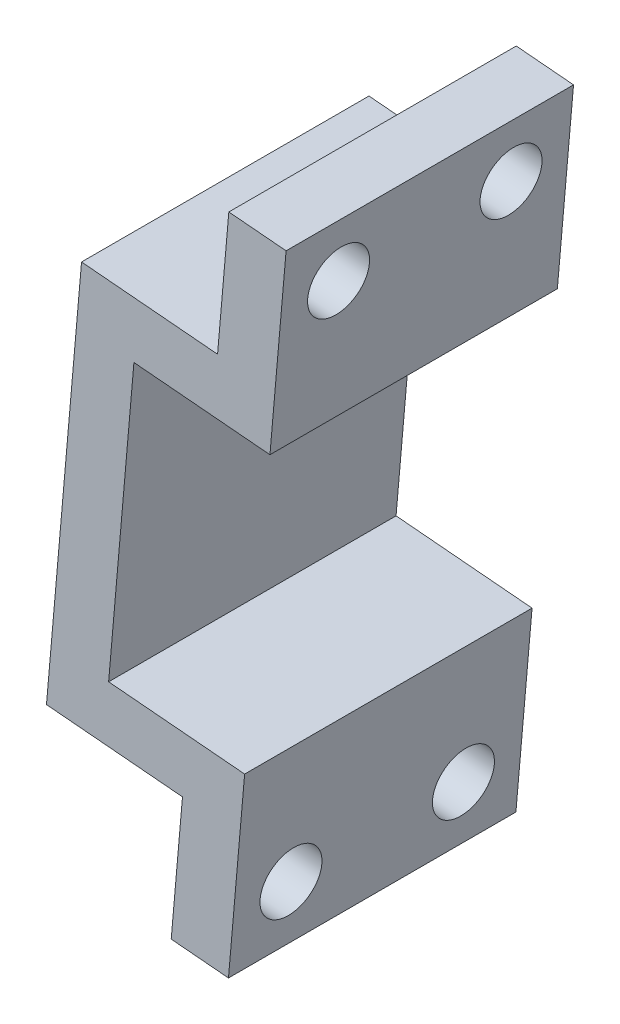
ISO-10303-21;
HEADER;
FILE_DESCRIPTION(('STEP AP214'),'2;1');
FILE_NAME('part.step','',(''),(''),'','','');
FILE_SCHEMA(('AUTOMOTIVE_DESIGN { 1 0 10303 214 1 1 1 1 }'));
ENDSEC;
DATA;
#1=APPLICATION_CONTEXT('core data for automotive mechanical design processes');
#2=APPLICATION_PROTOCOL_DEFINITION('international standard','automotive_design',2000,#1);
#3=PRODUCT_CONTEXT('',#1,'mechanical');
#4=PRODUCT('Part','Part','',(#3));
#5=PRODUCT_RELATED_PRODUCT_CATEGORY('part','',(#4));
#6=PRODUCT_DEFINITION_FORMATION('','',#4);
#7=PRODUCT_DEFINITION_CONTEXT('part definition',#1,'design');
#8=PRODUCT_DEFINITION('design','',#6,#7);
#9=PRODUCT_DEFINITION_SHAPE('','',#8);
#10=(LENGTH_UNIT() NAMED_UNIT(*) SI_UNIT(.MILLI.,.METRE.));
#11=(NAMED_UNIT(*) PLANE_ANGLE_UNIT() SI_UNIT($,.RADIAN.));
#12=(NAMED_UNIT(*) SI_UNIT($,.STERADIAN.) SOLID_ANGLE_UNIT());
#13=UNCERTAINTY_MEASURE_WITH_UNIT(LENGTH_MEASURE(1.E-05),#10,'distance_accuracy_value','');
#14=(GEOMETRIC_REPRESENTATION_CONTEXT(3) GLOBAL_UNCERTAINTY_ASSIGNED_CONTEXT((#13)) GLOBAL_UNIT_ASSIGNED_CONTEXT((#10,
#11,#12)) REPRESENTATION_CONTEXT('',''));
#15=CARTESIAN_POINT('',(0.,0.,0.));
#16=DIRECTION('',(0.,0.,1.));
#17=DIRECTION('',(1.,0.,0.));
#18=AXIS2_PLACEMENT_3D('',#15,#16,#17);
#19=CARTESIAN_POINT('',(-81.4379855977888,9.99530320807717,-20.));
#20=DIRECTION('',(-0.996194698091746,0.0871557427476528,0.));
#21=DIRECTION('',(-0.0871557427476528,-0.996194698091746,0.));
#22=AXIS2_PLACEMENT_3D('',#19,#20,#21);
#23=PLANE('',#22);
#24=CARTESIAN_POINT('',(-81.0022068840506,14.9762766985351,-4.00000000000464));
#25=DIRECTION('',(-0.996194698091745,0.0871557427476621,0.));
#26=DIRECTION('',(-0.0871557427476621,-0.996194698091745,0.));
#27=AXIS2_PLACEMENT_3D('',#24,#25,#26);
#28=CIRCLE('',#27,2.15);
#29=CARTESIAN_POINT('',(-81.189591730958,12.8344580976379,-4.00000000000464));
#30=VERTEX_POINT('',#29);
#31=EDGE_CURVE('E327',#30,#30,#28,.T.);
#32=ORIENTED_EDGE('',*,*,#31,.F.);
#33=EDGE_LOOP('',(#32));
#34=FACE_BOUND('',#33,.T.);
#35=CARTESIAN_POINT('',(-81.0022068840506,14.9762766985351,-16.0000000000046));
#36=DIRECTION('',(-0.996194698091745,0.0871557427476621,0.));
#37=DIRECTION('',(-0.0871557427476621,-0.996194698091745,0.));
#38=AXIS2_PLACEMENT_3D('',#35,#36,#37);
#39=CIRCLE('',#38,2.15);
#40=CARTESIAN_POINT('',(-81.189591730958,12.8344580976379,-16.0000000000046));
#41=VERTEX_POINT('',#40);
#42=EDGE_CURVE('E325',#41,#41,#39,.T.);
#43=ORIENTED_EDGE('',*,*,#42,.F.);
#44=EDGE_LOOP('',(#43));
#45=FACE_BOUND('',#44,.T.);
#46=DIRECTION('',(-0.0871557427476528,-0.996194698091746,0.));
#47=VECTOR('',#46,1.);
#48=CARTESIAN_POINT('',(-81.4379855977888,9.99530320807717,0.));
#49=LINE('',#48,#47);
#50=CARTESIAN_POINT('',(-80.6535839130599,18.9610554909029,0.));
#51=VERTEX_POINT('',#50);
#52=CARTESIAN_POINT('',(-81.4379855977888,9.99530320807717,0.));
#53=VERTEX_POINT('',#52);
#54=EDGE_CURVE('E155',#51,#53,#49,.T.);
#55=ORIENTED_EDGE('',*,*,#54,.F.);
#56=DIRECTION('',(0.,0.,1.));
#57=VECTOR('',#56,1.);
#58=CARTESIAN_POINT('',(-80.6535839130599,18.9610554909029,-20.));
#59=LINE('',#58,#57);
#60=CARTESIAN_POINT('',(-80.6535839130599,18.9610554909029,-20.));
#61=VERTEX_POINT('',#60);
#62=EDGE_CURVE('E11',#61,#51,#59,.T.);
#63=ORIENTED_EDGE('',*,*,#62,.F.);
#64=DIRECTION('',(-0.0871557427476528,-0.996194698091746,0.));
#65=VECTOR('',#64,1.);
#66=CARTESIAN_POINT('',(-81.4379855977888,9.99530320807717,-20.));
#67=LINE('',#66,#65);
#68=CARTESIAN_POINT('',(-81.4379855977888,9.99530320807717,-20.));
#69=VERTEX_POINT('',#68);
#70=EDGE_CURVE('E187',#61,#69,#67,.T.);
#71=ORIENTED_EDGE('',*,*,#70,.T.);
#72=DIRECTION('',(0.,0.,1.));
#73=VECTOR('',#72,1.);
#74=CARTESIAN_POINT('',(-81.4379855977888,9.99530320807717,-20.));
#75=LINE('',#74,#73);
#76=EDGE_CURVE('E101',#69,#53,#75,.T.);
#77=ORIENTED_EDGE('',*,*,#76,.T.);
#78=EDGE_LOOP('',(#55,#63,#71,#77));
#79=FACE_BOUND('',#78,.T.);
#80=ADVANCED_FACE('F33',(#34,#45,#79),#23,.T.);
#81=CARTESIAN_POINT('',(-80.6535839130599,18.9610554909029,-20.));
#82=DIRECTION('',(0.0871557427476604,0.996194698091745,0.));
#83=DIRECTION('',(-0.996194698091745,0.0871557427476604,0.));
#84=AXIS2_PLACEMENT_3D('',#81,#82,#83);
#85=PLANE('',#84);
#86=DIRECTION('',(-0.996194698091745,0.0871557427476604,0.));
#87=VECTOR('',#86,1.);
#88=CARTESIAN_POINT('',(-80.6535839130599,18.9610554909029,0.));
#89=LINE('',#88,#87);
#90=CARTESIAN_POINT('',(-76.6688051206929,18.6124325199122,0.));
#91=VERTEX_POINT('',#90);
#92=EDGE_CURVE('E185',#91,#51,#89,.T.);
#93=ORIENTED_EDGE('',*,*,#92,.F.);
#94=DIRECTION('',(0.,0.,1.));
#95=VECTOR('',#94,1.);
#96=CARTESIAN_POINT('',(-76.6688051206929,18.6124325199122,-20.));
#97=LINE('',#96,#95);
#98=CARTESIAN_POINT('',(-76.6688051206929,18.6124325199122,-20.));
#99=VERTEX_POINT('',#98);
#100=EDGE_CURVE('E42',#99,#91,#97,.T.);
#101=ORIENTED_EDGE('',*,*,#100,.F.);
#102=DIRECTION('',(-0.996194698091745,0.0871557427476604,0.));
#103=VECTOR('',#102,1.);
#104=CARTESIAN_POINT('',(-80.6535839130599,18.9610554909029,-20.));
#105=LINE('',#104,#103);
#106=EDGE_CURVE('E145',#99,#61,#105,.T.);
#107=ORIENTED_EDGE('',*,*,#106,.T.);
#108=ORIENTED_EDGE('',*,*,#62,.T.);
#109=EDGE_LOOP('',(#93,#101,#107,#108));
#110=FACE_BOUND('',#109,.T.);
#111=ADVANCED_FACE('F267',(#110),#85,.T.);
#112=CARTESIAN_POINT('',(-76.6688051206929,18.6124325199122,-20.));
#113=DIRECTION('',(0.996194698091746,-0.0871557427476556,0.));
#114=DIRECTION('',(0.0871557427476556,0.996194698091746,0.));
#115=AXIS2_PLACEMENT_3D('',#112,#113,#114);
#116=PLANE('',#115);
#117=CARTESIAN_POINT('',(-77.0174280916836,14.6276537275445,-4.00000000000464));
#118=DIRECTION('',(0.996194698091746,-0.0871557427476556,0.));
#119=DIRECTION('',(0.0871557427476556,0.996194698091746,0.));
#120=AXIS2_PLACEMENT_3D('',#117,#118,#119);
#121=CIRCLE('',#120,2.15);
#122=CARTESIAN_POINT('',(-76.8300432447762,16.7694723284417,-4.00000000000464));
#123=VERTEX_POINT('',#122);
#124=EDGE_CURVE('E36',#123,#123,#121,.T.);
#125=ORIENTED_EDGE('',*,*,#124,.F.);
#126=EDGE_LOOP('',(#125));
#127=FACE_BOUND('',#126,.T.);
#128=CARTESIAN_POINT('',(-77.0174280916836,14.6276537275445,-16.0000000000046));
#129=DIRECTION('',(0.996194698091746,-0.0871557427476556,0.));
#130=DIRECTION('',(0.0871557427476556,0.996194698091746,0.));
#131=AXIS2_PLACEMENT_3D('',#128,#129,#130);
#132=CIRCLE('',#131,2.15);
#133=CARTESIAN_POINT('',(-76.8300432447762,16.7694723284417,-16.0000000000046));
#134=VERTEX_POINT('',#133);
#135=EDGE_CURVE('E205',#134,#134,#132,.T.);
#136=ORIENTED_EDGE('',*,*,#135,.F.);
#137=EDGE_LOOP('',(#136));
#138=FACE_BOUND('',#137,.T.);
#139=DIRECTION('',(0.0871557427476556,0.996194698091746,0.));
#140=VECTOR('',#139,1.);
#141=CARTESIAN_POINT('',(-76.6688051206929,18.6124325199122,0.));
#142=LINE('',#141,#140);
#143=CARTESIAN_POINT('',(-77.7931142021377,5.76152091452872,0.));
#144=VERTEX_POINT('',#143);
#145=EDGE_CURVE('E132',#144,#91,#142,.T.);
#146=ORIENTED_EDGE('',*,*,#145,.F.);
#147=DIRECTION('',(0.,0.,1.));
#148=VECTOR('',#147,1.);
#149=CARTESIAN_POINT('',(-77.7931142021377,5.76152091452872,-20.));
#150=LINE('',#149,#148);
#151=CARTESIAN_POINT('',(-77.7931142021377,5.76152091452872,-20.));
#152=VERTEX_POINT('',#151);
#153=EDGE_CURVE('E127',#152,#144,#150,.T.);
#154=ORIENTED_EDGE('',*,*,#153,.F.);
#155=DIRECTION('',(0.0871557427476556,0.996194698091746,0.));
#156=VECTOR('',#155,1.);
#157=CARTESIAN_POINT('',(-76.6688051206929,18.6124325199122,-20.));
#158=LINE('',#157,#156);
#159=EDGE_CURVE('E130',#152,#99,#158,.T.);
#160=ORIENTED_EDGE('',*,*,#159,.T.);
#161=ORIENTED_EDGE('',*,*,#100,.T.);
#162=EDGE_LOOP('',(#146,#154,#160,#161));
#163=FACE_BOUND('',#162,.T.);
#164=ADVANCED_FACE('F129',(#127,#138,#163),#116,.T.);
#165=CARTESIAN_POINT('',(-77.7931142021377,5.76152091452872,-20.));
#166=DIRECTION('',(-0.087155742747662,-0.996194698091745,0.));
#167=DIRECTION('',(0.996194698091745,-0.087155742747662,0.));
#168=AXIS2_PLACEMENT_3D('',#165,#166,#167);
#169=PLANE('',#168);
#170=DIRECTION('',(0.996194698091745,-0.087155742747662,0.));
#171=VECTOR('',#170,1.);
#172=CARTESIAN_POINT('',(-77.7931142021377,5.76152091452872,0.));
#173=LINE('',#172,#171);
#174=CARTESIAN_POINT('',(-87.2569638340093,6.58950047063151,0.));
#175=VERTEX_POINT('',#174);
#176=EDGE_CURVE('E182',#175,#144,#173,.T.);
#177=ORIENTED_EDGE('',*,*,#176,.F.);
#178=DIRECTION('',(0.,0.,1.));
#179=VECTOR('',#178,1.);
#180=CARTESIAN_POINT('',(-87.2569638340093,6.58950047063151,-20.));
#181=LINE('',#180,#179);
#182=CARTESIAN_POINT('',(-87.2569638340093,6.58950047063151,-20.));
#183=VERTEX_POINT('',#182);
#184=EDGE_CURVE('E137',#183,#175,#181,.T.);
#185=ORIENTED_EDGE('',*,*,#184,.F.);
#186=DIRECTION('',(0.996194698091745,-0.087155742747662,0.));
#187=VECTOR('',#186,1.);
#188=CARTESIAN_POINT('',(-77.7931142021377,5.76152091452872,-20.));
#189=LINE('',#188,#187);
#190=EDGE_CURVE('E143',#183,#152,#189,.T.);
#191=ORIENTED_EDGE('',*,*,#190,.T.);
#192=ORIENTED_EDGE('',*,*,#153,.T.);
#193=EDGE_LOOP('',(#177,#185,#191,#192));
#194=FACE_BOUND('',#193,.T.);
#195=ADVANCED_FACE('F147',(#194),#169,.T.);
#196=CARTESIAN_POINT('',(-87.2569638340093,6.58950047063151,-20.));
#197=DIRECTION('',(0.996194698091745,-0.0871557427476616,0.));
#198=DIRECTION('',(0.0871557427476616,0.996194698091745,0.));
#199=AXIS2_PLACEMENT_3D('',#196,#197,#198);
#200=PLANE('',#199);
#201=DIRECTION('',(0.0871557427476616,0.996194698091745,0.));
#202=VECTOR('',#201,1.);
#203=CARTESIAN_POINT('',(-87.2569638340093,6.58950047063151,0.));
#204=LINE('',#203,#202);
#205=CARTESIAN_POINT('',(-89.017509837512,-13.5336324308218,0.));
#206=VERTEX_POINT('',#205);
#207=EDGE_CURVE('E179',#206,#175,#204,.T.);
#208=ORIENTED_EDGE('',*,*,#207,.F.);
#209=DIRECTION('',(0.,0.,1.));
#210=VECTOR('',#209,1.);
#211=CARTESIAN_POINT('',(-89.017509837512,-13.5336324308218,-20.));
#212=LINE('',#211,#210);
#213=CARTESIAN_POINT('',(-89.017509837512,-13.5336324308218,-20.));
#214=VERTEX_POINT('',#213);
#215=EDGE_CURVE('E191',#214,#206,#212,.T.);
#216=ORIENTED_EDGE('',*,*,#215,.F.);
#217=DIRECTION('',(0.0871557427476616,0.996194698091745,0.));
#218=VECTOR('',#217,1.);
#219=CARTESIAN_POINT('',(-87.2569638340093,6.58950047063151,-20.));
#220=LINE('',#219,#218);
#221=EDGE_CURVE('E148',#214,#183,#220,.T.);
#222=ORIENTED_EDGE('',*,*,#221,.T.);
#223=ORIENTED_EDGE('',*,*,#184,.T.);
#224=EDGE_LOOP('',(#208,#216,#222,#223));
#225=FACE_BOUND('',#224,.T.);
#226=ADVANCED_FACE('F282',(#225),#200,.T.);
#227=CARTESIAN_POINT('',(-89.017509837512,-13.5336324308218,-20.));
#228=DIRECTION('',(0.0871557427476617,0.996194698091745,0.));
#229=DIRECTION('',(-0.996194698091745,0.0871557427476617,0.));
#230=AXIS2_PLACEMENT_3D('',#227,#228,#229);
#231=PLANE('',#230);
#232=DIRECTION('',(-0.996194698091745,0.0871557427476617,0.));
#233=VECTOR('',#232,1.);
#234=CARTESIAN_POINT('',(-89.017509837512,-13.5336324308218,0.));
#235=LINE('',#234,#233);
#236=CARTESIAN_POINT('',(-79.5536602056405,-14.3616119869246,0.));
#237=VERTEX_POINT('',#236);
#238=EDGE_CURVE('E176',#237,#206,#235,.T.);
#239=ORIENTED_EDGE('',*,*,#238,.F.);
#240=DIRECTION('',(0.,0.,1.));
#241=VECTOR('',#240,1.);
#242=CARTESIAN_POINT('',(-79.5536602056405,-14.3616119869246,-20.));
#243=LINE('',#242,#241);
#244=CARTESIAN_POINT('',(-79.5536602056405,-14.3616119869246,-20.));
#245=VERTEX_POINT('',#244);
#246=EDGE_CURVE('E193',#245,#237,#243,.T.);
#247=ORIENTED_EDGE('',*,*,#246,.F.);
#248=DIRECTION('',(-0.996194698091745,0.0871557427476617,0.));
#249=VECTOR('',#248,1.);
#250=CARTESIAN_POINT('',(-89.017509837512,-13.5336324308218,-20.));
#251=LINE('',#250,#249);
#252=EDGE_CURVE('E150',#245,#214,#251,.T.);
#253=ORIENTED_EDGE('',*,*,#252,.T.);
#254=ORIENTED_EDGE('',*,*,#215,.T.);
#255=EDGE_LOOP('',(#239,#247,#253,#254));
#256=FACE_BOUND('',#255,.T.);
#257=ADVANCED_FACE('F242',(#256),#231,.T.);
#258=CARTESIAN_POINT('',(-79.5536602056405,-14.3616119869246,-20.));
#259=DIRECTION('',(0.996194698091745,-0.0871557427476612,0.));
#260=DIRECTION('',(0.0871557427476612,0.996194698091745,0.));
#261=AXIS2_PLACEMENT_3D('',#258,#259,#260);
#262=PLANE('',#261);
#263=CARTESIAN_POINT('',(-80.3293463160947,-23.2277447999419,-16.0000000000046));
#264=DIRECTION('',(0.996194698091745,-0.0871557427476612,0.));
#265=DIRECTION('',(0.0871557427476612,0.996194698091745,0.));
#266=AXIS2_PLACEMENT_3D('',#263,#264,#265);
#267=CIRCLE('',#266,2.15000000000002);
#268=CARTESIAN_POINT('',(-80.1419614691873,-21.0859261990446,-16.0000000000046));
#269=VERTEX_POINT('',#268);
#270=EDGE_CURVE('E207',#269,#269,#267,.T.);
#271=ORIENTED_EDGE('',*,*,#270,.F.);
#272=EDGE_LOOP('',(#271));
#273=FACE_BOUND('',#272,.T.);
#274=CARTESIAN_POINT('',(-80.3293463160947,-23.2277447999419,-4.00000000000464));
#275=DIRECTION('',(0.996194698091745,-0.0871557427476612,0.));
#276=DIRECTION('',(0.0871557427476612,0.996194698091745,0.));
#277=AXIS2_PLACEMENT_3D('',#274,#275,#276);
#278=CIRCLE('',#277,2.15000000000002);
#279=CARTESIAN_POINT('',(-80.1419614691873,-21.0859261990446,-4.00000000000464));
#280=VERTEX_POINT('',#279);
#281=EDGE_CURVE('E212',#280,#280,#278,.T.);
#282=ORIENTED_EDGE('',*,*,#281,.F.);
#283=EDGE_LOOP('',(#282));
#284=FACE_BOUND('',#283,.T.);
#285=DIRECTION('',(0.0871557427476612,0.996194698091745,0.));
#286=VECTOR('',#285,1.);
#287=CARTESIAN_POINT('',(-79.5536602056405,-14.3616119869246,0.));
#288=LINE('',#287,#286);
#289=CARTESIAN_POINT('',(-80.6779692870853,-27.2125235923081,0.));
#290=VERTEX_POINT('',#289);
#291=EDGE_CURVE('E173',#290,#237,#288,.T.);
#292=ORIENTED_EDGE('',*,*,#291,.F.);
#293=DIRECTION('',(0.,0.,1.));
#294=VECTOR('',#293,1.);
#295=CARTESIAN_POINT('',(-80.6779692870853,-27.2125235923081,-20.));
#296=LINE('',#295,#294);
#297=CARTESIAN_POINT('',(-80.6779692870853,-27.2125235923081,-20.));
#298=VERTEX_POINT('',#297);
#299=EDGE_CURVE('E195',#298,#290,#296,.T.);
#300=ORIENTED_EDGE('',*,*,#299,.F.);
#301=DIRECTION('',(0.0871557427476612,0.996194698091745,0.));
#302=VECTOR('',#301,1.);
#303=CARTESIAN_POINT('',(-79.5536602056405,-14.3616119869246,-20.));
#304=LINE('',#303,#302);
#305=EDGE_CURVE('E236',#298,#245,#304,.T.);
#306=ORIENTED_EDGE('',*,*,#305,.T.);
#307=ORIENTED_EDGE('',*,*,#246,.T.);
#308=EDGE_LOOP('',(#292,#300,#306,#307));
#309=FACE_BOUND('',#308,.T.);
#310=ADVANCED_FACE('F248',(#273,#284,#309),#262,.T.);
#311=CARTESIAN_POINT('',(-80.6779692870853,-27.2125235923081,-20.));
#312=DIRECTION('',(-0.0871557427476612,-0.996194698091745,0.));
#313=DIRECTION('',(0.996194698091745,-0.0871557427476612,0.));
#314=AXIS2_PLACEMENT_3D('',#311,#312,#313);
#315=PLANE('',#314);
#316=DIRECTION('',(0.996194698091745,-0.0871557427476612,0.));
#317=VECTOR('',#316,1.);
#318=CARTESIAN_POINT('',(-80.6779692870853,-27.2125235923081,0.));
#319=LINE('',#318,#317);
#320=CARTESIAN_POINT('',(-84.6627480794523,-26.8639006213174,0.));
#321=VERTEX_POINT('',#320);
#322=EDGE_CURVE('E170',#321,#290,#319,.T.);
#323=ORIENTED_EDGE('',*,*,#322,.F.);
#324=DIRECTION('',(0.,0.,1.));
#325=VECTOR('',#324,1.);
#326=CARTESIAN_POINT('',(-84.6627480794523,-26.8639006213174,-20.));
#327=LINE('',#326,#325);
#328=CARTESIAN_POINT('',(-84.6627480794523,-26.8639006213174,-20.));
#329=VERTEX_POINT('',#328);
#330=EDGE_CURVE('E197',#329,#321,#327,.T.);
#331=ORIENTED_EDGE('',*,*,#330,.F.);
#332=DIRECTION('',(0.996194698091745,-0.0871557427476612,0.));
#333=VECTOR('',#332,1.);
#334=CARTESIAN_POINT('',(-80.6779692870853,-27.2125235923081,-20.));
#335=LINE('',#334,#333);
#336=EDGE_CURVE('E233',#329,#298,#335,.T.);
#337=ORIENTED_EDGE('',*,*,#336,.T.);
#338=ORIENTED_EDGE('',*,*,#299,.T.);
#339=EDGE_LOOP('',(#323,#331,#337,#338));
#340=FACE_BOUND('',#339,.T.);
#341=ADVANCED_FACE('F251',(#340),#315,.T.);
#342=CARTESIAN_POINT('',(-84.6627480794523,-26.8639006213174,-20.));
#343=DIRECTION('',(-0.996194698091745,0.0871557427476607,0.));
#344=DIRECTION('',(-0.0871557427476607,-0.996194698091745,0.));
#345=AXIS2_PLACEMENT_3D('',#342,#343,#344);
#346=PLANE('',#345);
#347=CARTESIAN_POINT('',(-84.3141251084617,-22.8791218289512,-16.0000000000046));
#348=DIRECTION('',(-0.996194698091745,0.0871557427476621,0.));
#349=DIRECTION('',(-0.0871557427476621,-0.996194698091745,0.));
#350=AXIS2_PLACEMENT_3D('',#347,#348,#349);
#351=CIRCLE('',#350,2.15000000000002);
#352=CARTESIAN_POINT('',(-84.5015099553692,-25.0209404298485,-16.0000000000046));
#353=VERTEX_POINT('',#352);
#354=EDGE_CURVE('E330',#353,#353,#351,.T.);
#355=ORIENTED_EDGE('',*,*,#354,.F.);
#356=EDGE_LOOP('',(#355));
#357=FACE_BOUND('',#356,.T.);
#358=CARTESIAN_POINT('',(-84.3141251084617,-22.8791218289512,-4.00000000000464));
#359=DIRECTION('',(-0.996194698091745,0.0871557427476621,0.));
#360=DIRECTION('',(-0.0871557427476621,-0.996194698091745,0.));
#361=AXIS2_PLACEMENT_3D('',#358,#359,#360);
#362=CIRCLE('',#361,2.15000000000002);
#363=CARTESIAN_POINT('',(-84.5015099553692,-25.0209404298485,-4.00000000000464));
#364=VERTEX_POINT('',#363);
#365=EDGE_CURVE('E217',#364,#364,#362,.T.);
#366=ORIENTED_EDGE('',*,*,#365,.F.);
#367=EDGE_LOOP('',(#366));
#368=FACE_BOUND('',#367,.T.);
#369=DIRECTION('',(-0.0871557427476607,-0.996194698091745,0.));
#370=VECTOR('',#369,1.);
#371=CARTESIAN_POINT('',(-84.6627480794523,-26.8639006213174,0.));
#372=LINE('',#371,#370);
#373=CARTESIAN_POINT('',(-83.8783463947233,-17.8981483384917,0.));
#374=VERTEX_POINT('',#373);
#375=EDGE_CURVE('E167',#374,#321,#372,.T.);
#376=ORIENTED_EDGE('',*,*,#375,.F.);
#377=DIRECTION('',(0.,0.,1.));
#378=VECTOR('',#377,1.);
#379=CARTESIAN_POINT('',(-83.8783463947233,-17.8981483384917,-20.));
#380=LINE('',#379,#378);
#381=CARTESIAN_POINT('',(-83.8783463947233,-17.8981483384917,-20.));
#382=VERTEX_POINT('',#381);
#383=EDGE_CURVE('E199',#382,#374,#380,.T.);
#384=ORIENTED_EDGE('',*,*,#383,.F.);
#385=DIRECTION('',(-0.0871557427476607,-0.996194698091745,0.));
#386=VECTOR('',#385,1.);
#387=CARTESIAN_POINT('',(-84.6627480794523,-26.8639006213174,-20.));
#388=LINE('',#387,#386);
#389=EDGE_CURVE('E230',#382,#329,#388,.T.);
#390=ORIENTED_EDGE('',*,*,#389,.T.);
#391=ORIENTED_EDGE('',*,*,#330,.T.);
#392=EDGE_LOOP('',(#376,#384,#390,#391));
#393=FACE_BOUND('',#392,.T.);
#394=ADVANCED_FACE('F256',(#357,#368,#393),#346,.T.);
#395=CARTESIAN_POINT('',(-83.8783463947233,-17.8981483384917,-20.));
#396=DIRECTION('',(-0.0871557427476612,-0.996194698091745,0.));
#397=DIRECTION('',(0.996194698091745,-0.0871557427476612,0.));
#398=AXIS2_PLACEMENT_3D('',#395,#396,#397);
#399=PLANE('',#398);
#400=DIRECTION('',(0.996194698091745,-0.0871557427476612,0.));
#401=VECTOR('',#400,1.);
#402=CARTESIAN_POINT('',(-83.8783463947233,-17.8981483384917,0.));
#403=LINE('',#402,#401);
#404=CARTESIAN_POINT('',(-93.3421960265949,-17.070168782389,0.));
#405=VERTEX_POINT('',#404);
#406=EDGE_CURVE('E164',#405,#374,#403,.T.);
#407=ORIENTED_EDGE('',*,*,#406,.F.);
#408=DIRECTION('',(0.,0.,1.));
#409=VECTOR('',#408,1.);
#410=CARTESIAN_POINT('',(-93.3421960265949,-17.070168782389,-20.));
#411=LINE('',#410,#409);
#412=CARTESIAN_POINT('',(-93.3421960265949,-17.070168782389,-20.));
#413=VERTEX_POINT('',#412);
#414=EDGE_CURVE('E201',#413,#405,#411,.T.);
#415=ORIENTED_EDGE('',*,*,#414,.F.);
#416=DIRECTION('',(0.996194698091745,-0.0871557427476612,0.));
#417=VECTOR('',#416,1.);
#418=CARTESIAN_POINT('',(-83.8783463947233,-17.8981483384917,-20.));
#419=LINE('',#418,#417);
#420=EDGE_CURVE('E227',#413,#382,#419,.T.);
#421=ORIENTED_EDGE('',*,*,#420,.T.);
#422=ORIENTED_EDGE('',*,*,#383,.T.);
#423=EDGE_LOOP('',(#407,#415,#421,#422));
#424=FACE_BOUND('',#423,.T.);
#425=ADVANCED_FACE('F259',(#424),#399,.T.);
#426=CARTESIAN_POINT('',(-93.3421960265949,-17.070168782389,-20.));
#427=DIRECTION('',(-0.996194698091745,0.0871557427476613,0.));
#428=DIRECTION('',(-0.0871557427476613,-0.996194698091745,0.));
#429=AXIS2_PLACEMENT_3D('',#426,#427,#428);
#430=PLANE('',#429);
#431=DIRECTION('',(-0.0871557427476613,-0.996194698091745,0.));
#432=VECTOR('',#431,1.);
#433=CARTESIAN_POINT('',(-93.3421960265949,-17.070168782389,0.));
#434=LINE('',#433,#432);
#435=CARTESIAN_POINT('',(-90.9018352296604,10.82328276418,0.));
#436=VERTEX_POINT('',#435);
#437=EDGE_CURVE('E161',#436,#405,#434,.T.);
#438=ORIENTED_EDGE('',*,*,#437,.F.);
#439=DIRECTION('',(0.,0.,1.));
#440=VECTOR('',#439,1.);
#441=CARTESIAN_POINT('',(-90.9018352296604,10.82328276418,-20.));
#442=LINE('',#441,#440);
#443=CARTESIAN_POINT('',(-90.9018352296604,10.82328276418,-20.));
#444=VERTEX_POINT('',#443);
#445=EDGE_CURVE('E203',#444,#436,#442,.T.);
#446=ORIENTED_EDGE('',*,*,#445,.F.);
#447=DIRECTION('',(-0.0871557427476613,-0.996194698091745,0.));
#448=VECTOR('',#447,1.);
#449=CARTESIAN_POINT('',(-93.3421960265949,-17.070168782389,-20.));
#450=LINE('',#449,#448);
#451=EDGE_CURVE('E224',#444,#413,#450,.T.);
#452=ORIENTED_EDGE('',*,*,#451,.T.);
#453=ORIENTED_EDGE('',*,*,#414,.T.);
#454=EDGE_LOOP('',(#438,#446,#452,#453));
#455=FACE_BOUND('',#454,.T.);
#456=ADVANCED_FACE('F263',(#455),#430,.T.);
#457=CARTESIAN_POINT('',(-90.9018352296604,10.82328276418,-20.));
#458=DIRECTION('',(0.0871557427476613,0.996194698091745,0.));
#459=DIRECTION('',(-0.996194698091745,0.0871557427476613,0.));
#460=AXIS2_PLACEMENT_3D('',#457,#458,#459);
#461=PLANE('',#460);
#462=DIRECTION('',(-0.996194698091745,0.0871557427476613,0.));
#463=VECTOR('',#462,1.);
#464=CARTESIAN_POINT('',(-90.9018352296604,10.82328276418,0.));
#465=LINE('',#464,#463);
#466=EDGE_CURVE('E158',#53,#436,#465,.T.);
#467=ORIENTED_EDGE('',*,*,#466,.F.);
#468=ORIENTED_EDGE('',*,*,#76,.F.);
#469=DIRECTION('',(-0.996194698091745,0.0871557427476613,0.));
#470=VECTOR('',#469,1.);
#471=CARTESIAN_POINT('',(-90.9018352296604,10.82328276418,-20.));
#472=LINE('',#471,#470);
#473=EDGE_CURVE('E222',#69,#444,#472,.T.);
#474=ORIENTED_EDGE('',*,*,#473,.T.);
#475=ORIENTED_EDGE('',*,*,#445,.T.);
#476=EDGE_LOOP('',(#467,#468,#474,#475));
#477=FACE_BOUND('',#476,.T.);
#478=ADVANCED_FACE('F264',(#477),#461,.T.);
#479=CARTESIAN_POINT('',(0.,0.,-20.));
#480=DIRECTION('',(0.,0.,-1.));
#481=DIRECTION('',(-1.,0.,0.));
#482=AXIS2_PLACEMENT_3D('',#479,#480,#481);
#483=PLANE('',#482);
#484=ORIENTED_EDGE('',*,*,#70,.F.);
#485=ORIENTED_EDGE('',*,*,#106,.F.);
#486=ORIENTED_EDGE('',*,*,#159,.F.);
#487=ORIENTED_EDGE('',*,*,#190,.F.);
#488=ORIENTED_EDGE('',*,*,#221,.F.);
#489=ORIENTED_EDGE('',*,*,#252,.F.);
#490=ORIENTED_EDGE('',*,*,#305,.F.);
#491=ORIENTED_EDGE('',*,*,#336,.F.);
#492=ORIENTED_EDGE('',*,*,#389,.F.);
#493=ORIENTED_EDGE('',*,*,#420,.F.);
#494=ORIENTED_EDGE('',*,*,#451,.F.);
#495=ORIENTED_EDGE('',*,*,#473,.F.);
#496=EDGE_LOOP('',(#484,#485,#486,#487,#488,#489,#490,#491,#492,#493,#494,#495));
#497=FACE_BOUND('',#496,.T.);
#498=ADVANCED_FACE('F141',(#497),#483,.T.);
#499=CARTESIAN_POINT('',(0.,0.,0.));
#500=DIRECTION('',(0.,0.,-1.));
#501=DIRECTION('',(-1.,0.,0.));
#502=AXIS2_PLACEMENT_3D('',#499,#500,#501);
#503=PLANE('',#502);
#504=ORIENTED_EDGE('',*,*,#54,.T.);
#505=ORIENTED_EDGE('',*,*,#466,.T.);
#506=ORIENTED_EDGE('',*,*,#437,.T.);
#507=ORIENTED_EDGE('',*,*,#406,.T.);
#508=ORIENTED_EDGE('',*,*,#375,.T.);
#509=ORIENTED_EDGE('',*,*,#322,.T.);
#510=ORIENTED_EDGE('',*,*,#291,.T.);
#511=ORIENTED_EDGE('',*,*,#238,.T.);
#512=ORIENTED_EDGE('',*,*,#207,.T.);
#513=ORIENTED_EDGE('',*,*,#176,.T.);
#514=ORIENTED_EDGE('',*,*,#145,.T.);
#515=ORIENTED_EDGE('',*,*,#92,.T.);
#516=EDGE_LOOP('',(#504,#505,#506,#507,#508,#509,#510,#511,#512,#513,#514,#515));
#517=FACE_BOUND('',#516,.T.);
#518=ADVANCED_FACE('F266',(#517),#503,.F.);
#519=CARTESIAN_POINT('',(-79.333151618003,-23.3149005426895,-4.00000000000464));
#520=DIRECTION('',(-0.996194698091745,0.0871557427476621,0.));
#521=DIRECTION('',(-0.0871557427476621,-0.996194698091745,0.));
#522=AXIS2_PLACEMENT_3D('',#519,#520,#521);
#523=CYLINDRICAL_SURFACE('',#522,2.15000000000002);
#524=ORIENTED_EDGE('',*,*,#281,.T.);
#525=EDGE_LOOP('',(#524));
#526=FACE_BOUND('',#525,.T.);
#527=ORIENTED_EDGE('',*,*,#365,.T.);
#528=EDGE_LOOP('',(#527));
#529=FACE_BOUND('',#528,.T.);
#530=ADVANCED_FACE('F306',(#526,#529),#523,.F.);
#531=CARTESIAN_POINT('',(-79.333151618003,-23.3149005426895,-16.0000000000046));
#532=DIRECTION('',(-0.996194698091745,0.0871557427476621,0.));
#533=DIRECTION('',(-0.0871557427476621,-0.996194698091745,0.));
#534=AXIS2_PLACEMENT_3D('',#531,#532,#533);
#535=CYLINDRICAL_SURFACE('',#534,2.15000000000002);
#536=ORIENTED_EDGE('',*,*,#270,.T.);
#537=EDGE_LOOP('',(#536));
#538=FACE_BOUND('',#537,.T.);
#539=ORIENTED_EDGE('',*,*,#354,.T.);
#540=EDGE_LOOP('',(#539));
#541=FACE_BOUND('',#540,.T.);
#542=ADVANCED_FACE('F310',(#538,#541),#535,.F.);
#543=CARTESIAN_POINT('',(-76.0212333935918,14.5404979847968,-16.0000000000046));
#544=DIRECTION('',(-0.996194698091745,0.0871557427476621,0.));
#545=DIRECTION('',(-0.0871557427476621,-0.996194698091745,0.));
#546=AXIS2_PLACEMENT_3D('',#543,#544,#545);
#547=CYLINDRICAL_SURFACE('',#546,2.15);
#548=ORIENTED_EDGE('',*,*,#135,.T.);
#549=EDGE_LOOP('',(#548));
#550=FACE_BOUND('',#549,.T.);
#551=ORIENTED_EDGE('',*,*,#42,.T.);
#552=EDGE_LOOP('',(#551));
#553=FACE_BOUND('',#552,.T.);
#554=ADVANCED_FACE('F315',(#550,#553),#547,.F.);
#555=CARTESIAN_POINT('',(-76.0212333935918,14.5404979847968,-4.00000000000464));
#556=DIRECTION('',(-0.996194698091745,0.0871557427476621,0.));
#557=DIRECTION('',(-0.0871557427476621,-0.996194698091745,0.));
#558=AXIS2_PLACEMENT_3D('',#555,#556,#557);
#559=CYLINDRICAL_SURFACE('',#558,2.15);
#560=ORIENTED_EDGE('',*,*,#124,.T.);
#561=EDGE_LOOP('',(#560));
#562=FACE_BOUND('',#561,.T.);
#563=ORIENTED_EDGE('',*,*,#31,.T.);
#564=EDGE_LOOP('',(#563));
#565=FACE_BOUND('',#564,.T.);
#566=ADVANCED_FACE('F312',(#562,#565),#559,.F.);
#567=CLOSED_SHELL('',(#80,#111,#164,#195,#226,#257,#310,#341,#394,#425,#456,#478,#498,#518,#530,
#542,#554,#566));
#568=MANIFOLD_SOLID_BREP('B2',#567);
#569=ADVANCED_BREP_SHAPE_REPRESENTATION('',(#18,#568),#14);
#570=SHAPE_DEFINITION_REPRESENTATION(#9,#569);
ENDSEC;
END-ISO-10303-21;
